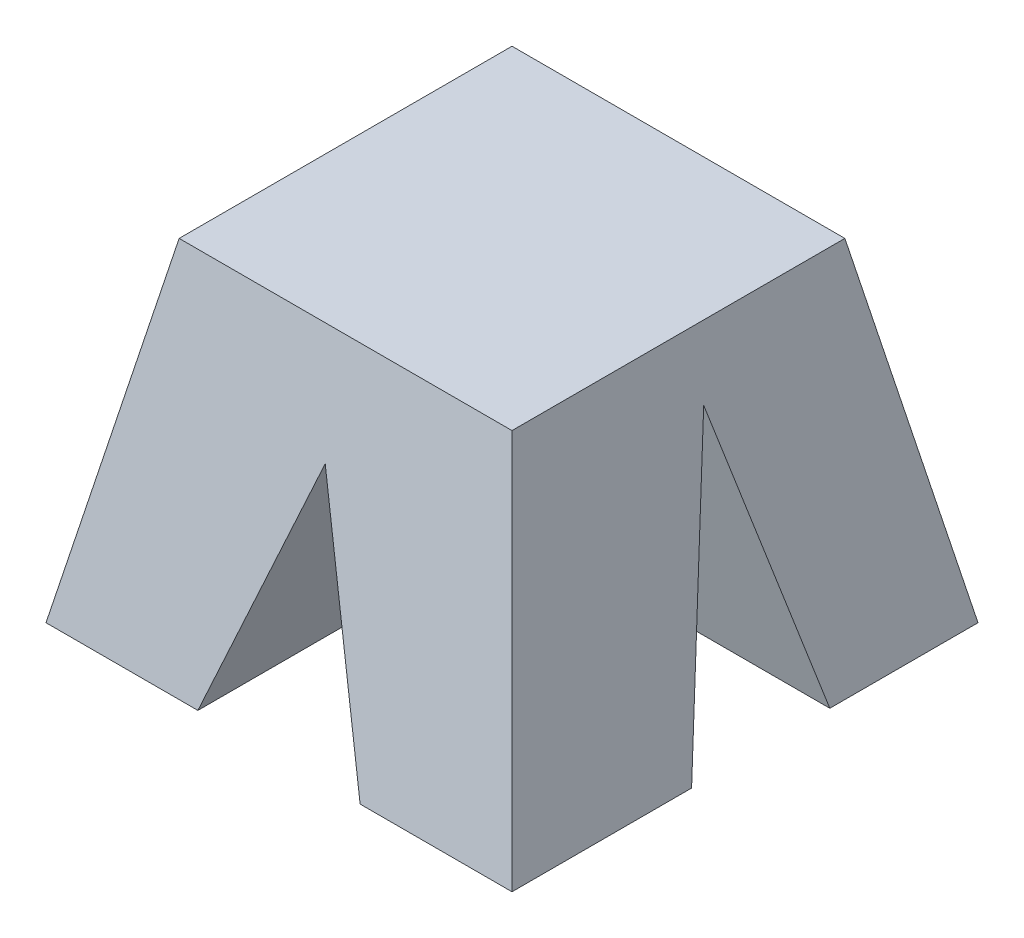
ISO-10303-21;
HEADER;
FILE_DESCRIPTION(('STEP AP214'),'2;1');
FILE_NAME('part.step','',(''),(''),'','','');
FILE_SCHEMA(('AUTOMOTIVE_DESIGN { 1 0 10303 214 1 1 1 1 }'));
ENDSEC;
DATA;
#1=APPLICATION_CONTEXT('core data for automotive mechanical design processes');
#2=APPLICATION_PROTOCOL_DEFINITION('international standard','automotive_design',2000,#1);
#3=PRODUCT_CONTEXT('',#1,'mechanical');
#4=PRODUCT('Part','Part','',(#3));
#5=PRODUCT_RELATED_PRODUCT_CATEGORY('part','',(#4));
#6=PRODUCT_DEFINITION_FORMATION('','',#4);
#7=PRODUCT_DEFINITION_CONTEXT('part definition',#1,'design');
#8=PRODUCT_DEFINITION('design','',#6,#7);
#9=PRODUCT_DEFINITION_SHAPE('','',#8);
#10=(LENGTH_UNIT() NAMED_UNIT(*) SI_UNIT(.MILLI.,.METRE.));
#11=(NAMED_UNIT(*) PLANE_ANGLE_UNIT() SI_UNIT($,.RADIAN.));
#12=(NAMED_UNIT(*) SI_UNIT($,.STERADIAN.) SOLID_ANGLE_UNIT());
#13=UNCERTAINTY_MEASURE_WITH_UNIT(LENGTH_MEASURE(1.E-05),#10,'distance_accuracy_value','');
#14=(GEOMETRIC_REPRESENTATION_CONTEXT(3) GLOBAL_UNCERTAINTY_ASSIGNED_CONTEXT((#13)) GLOBAL_UNIT_ASSIGNED_CONTEXT((#10,
#11,#12)) REPRESENTATION_CONTEXT('',''));
#15=CARTESIAN_POINT('',(0.,0.,0.));
#16=DIRECTION('',(0.,0.,1.));
#17=DIRECTION('',(1.,0.,0.));
#18=AXIS2_PLACEMENT_3D('',#15,#16,#17);
#19=CARTESIAN_POINT('',(0.,-5.,0.));
#20=DIRECTION('',(0.,-1.,0.));
#21=DIRECTION('',(0.,0.,-1.));
#22=AXIS2_PLACEMENT_3D('',#19,#20,#21);
#23=PLANE('',#22);
#24=DIRECTION('',(0.,0.,1.));
#25=VECTOR('',#24,1.);
#26=CARTESIAN_POINT('',(0.487414429426886,-5.,0.));
#27=LINE('',#26,#25);
#28=CARTESIAN_POINT('',(0.487414429426886,-5.,1.32095885605147));
#29=VERTEX_POINT('',#28);
#30=CARTESIAN_POINT('',(0.487414429426886,-5.,2.4));
#31=VERTEX_POINT('',#30);
#32=EDGE_CURVE('E167',#29,#31,#27,.T.);
#33=ORIENTED_EDGE('',*,*,#32,.F.);
#34=DIRECTION('',(-1.,0.,0.));
#35=VECTOR('',#34,1.);
#36=CARTESIAN_POINT('',(0.,-5.,1.32095885605147));
#37=LINE('',#36,#35);
#38=CARTESIAN_POINT('',(1.4,-5.,1.32095885605147));
#39=VERTEX_POINT('',#38);
#40=EDGE_CURVE('E207',#39,#29,#37,.T.);
#41=ORIENTED_EDGE('',*,*,#40,.F.);
#42=DIRECTION('',(0.,0.,1.));
#43=VECTOR('',#42,1.);
#44=CARTESIAN_POINT('',(1.4,-5.,-0.4));
#45=LINE('',#44,#43);
#46=CARTESIAN_POINT('',(1.4,-5.,2.4));
#47=VERTEX_POINT('',#46);
#48=EDGE_CURVE('E290',#39,#47,#45,.T.);
#49=ORIENTED_EDGE('',*,*,#48,.T.);
#50=DIRECTION('',(-1.,0.,0.));
#51=VECTOR('',#50,1.);
#52=CARTESIAN_POINT('',(1.4,-5.,2.4));
#53=LINE('',#52,#51);
#54=EDGE_CURVE('E304',#47,#31,#53,.T.);
#55=ORIENTED_EDGE('',*,*,#54,.T.);
#56=EDGE_LOOP('',(#33,#41,#49,#55));
#57=FACE_BOUND('',#56,.T.);
#58=ADVANCED_FACE('F44',(#57),#23,.T.);
#59=DIRECTION('',(0.,0.,1.));
#60=VECTOR('',#59,1.);
#61=CARTESIAN_POINT('',(0.487414429426886,-5.,0.));
#62=LINE('',#61,#60);
#63=CARTESIAN_POINT('',(0.487414429426886,-5.,-0.4));
#64=VERTEX_POINT('',#63);
#65=CARTESIAN_POINT('',(0.487414429426886,-5.,0.490309637659192));
#66=VERTEX_POINT('',#65);
#67=EDGE_CURVE('E164',#64,#66,#62,.T.);
#68=ORIENTED_EDGE('',*,*,#67,.F.);
#69=DIRECTION('',(1.,0.,0.));
#70=VECTOR('',#69,1.);
#71=CARTESIAN_POINT('',(1.4,-5.,-0.4));
#72=LINE('',#71,#70);
#73=CARTESIAN_POINT('',(1.4,-5.,-0.4));
#74=VERTEX_POINT('',#73);
#75=EDGE_CURVE('E161',#64,#74,#72,.T.);
#76=ORIENTED_EDGE('',*,*,#75,.T.);
#77=CARTESIAN_POINT('',(1.4,-5.,0.490309637659191));
#78=VERTEX_POINT('',#77);
#79=EDGE_CURVE('E287',#74,#78,#45,.T.);
#80=ORIENTED_EDGE('',*,*,#79,.T.);
#81=DIRECTION('',(1.,0.,0.));
#82=VECTOR('',#81,1.);
#83=CARTESIAN_POINT('',(0.,-5.,0.490309637659192));
#84=LINE('',#83,#82);
#85=EDGE_CURVE('E187',#66,#78,#84,.T.);
#86=ORIENTED_EDGE('',*,*,#85,.F.);
#87=EDGE_LOOP('',(#68,#76,#80,#86));
#88=FACE_BOUND('',#87,.T.);
#89=ADVANCED_FACE('F472',(#88),#23,.T.);
#90=DIRECTION('',(0.,0.,-1.));
#91=VECTOR('',#90,1.);
#92=CARTESIAN_POINT('',(-0.487414429426885,-5.,0.));
#93=LINE('',#92,#91);
#94=CARTESIAN_POINT('',(-0.487414429426885,-5.,2.4));
#95=VERTEX_POINT('',#94);
#96=CARTESIAN_POINT('',(-0.487414429426885,-5.,1.32095885605147));
#97=VERTEX_POINT('',#96);
#98=EDGE_CURVE('E63',#95,#97,#93,.T.);
#99=ORIENTED_EDGE('',*,*,#98,.F.);
#100=CARTESIAN_POINT('',(-1.4,-5.,2.4));
#101=VERTEX_POINT('',#100);
#102=EDGE_CURVE('E49',#95,#101,#53,.T.);
#103=ORIENTED_EDGE('',*,*,#102,.T.);
#104=DIRECTION('',(0.,0.,-1.));
#105=VECTOR('',#104,1.);
#106=CARTESIAN_POINT('',(-1.4,-5.,-0.4));
#107=LINE('',#106,#105);
#108=CARTESIAN_POINT('',(-1.4,-5.,1.32095885605147));
#109=VERTEX_POINT('',#108);
#110=EDGE_CURVE('E292',#101,#109,#107,.T.);
#111=ORIENTED_EDGE('',*,*,#110,.T.);
#112=EDGE_CURVE('E204',#97,#109,#37,.T.);
#113=ORIENTED_EDGE('',*,*,#112,.F.);
#114=EDGE_LOOP('',(#99,#103,#111,#113));
#115=FACE_BOUND('',#114,.T.);
#116=ADVANCED_FACE('F470',(#115),#23,.T.);
#117=DIRECTION('',(0.,0.,-1.));
#118=VECTOR('',#117,1.);
#119=CARTESIAN_POINT('',(-0.487414429426885,-5.,0.));
#120=LINE('',#119,#118);
#121=CARTESIAN_POINT('',(-0.487414429426885,-5.,0.490309637659192));
#122=VERTEX_POINT('',#121);
#123=CARTESIAN_POINT('',(-0.487414429426885,-5.,-0.4));
#124=VERTEX_POINT('',#123);
#125=EDGE_CURVE('E144',#122,#124,#120,.T.);
#126=ORIENTED_EDGE('',*,*,#125,.F.);
#127=CARTESIAN_POINT('',(-1.4,-5.,0.490309637659191));
#128=VERTEX_POINT('',#127);
#129=EDGE_CURVE('E188',#128,#122,#84,.T.);
#130=ORIENTED_EDGE('',*,*,#129,.F.);
#131=CARTESIAN_POINT('',(-1.4,-5.,-0.4));
#132=VERTEX_POINT('',#131);
#133=EDGE_CURVE('E199',#128,#132,#107,.T.);
#134=ORIENTED_EDGE('',*,*,#133,.T.);
#135=EDGE_CURVE('E302',#132,#124,#72,.T.);
#136=ORIENTED_EDGE('',*,*,#135,.T.);
#137=EDGE_LOOP('',(#126,#130,#134,#136));
#138=FACE_BOUND('',#137,.T.);
#139=ADVANCED_FACE('F46',(#138),#23,.T.);
#140=CARTESIAN_POINT('',(0.,-3.,0.));
#141=DIRECTION('',(0.,-1.,0.));
#142=DIRECTION('',(0.,0.,-1.));
#143=AXIS2_PLACEMENT_3D('',#140,#141,#142);
#144=PLANE('',#143);
#145=DIRECTION('',(0.,0.,-1.));
#146=VECTOR('',#145,1.);
#147=CARTESIAN_POINT('',(-1.,-3.,2.));
#148=LINE('',#147,#146);
#149=CARTESIAN_POINT('',(-1.,-3.,2.));
#150=VERTEX_POINT('',#149);
#151=CARTESIAN_POINT('',(-1.,-3.,0.));
#152=VERTEX_POINT('',#151);
#153=EDGE_CURVE('E217',#150,#152,#148,.T.);
#154=ORIENTED_EDGE('',*,*,#153,.F.);
#155=DIRECTION('',(-1.,0.,0.));
#156=VECTOR('',#155,1.);
#157=CARTESIAN_POINT('',(-1.,-3.,2.));
#158=LINE('',#157,#156);
#159=CARTESIAN_POINT('',(1.,-3.,2.));
#160=VERTEX_POINT('',#159);
#161=EDGE_CURVE('E225',#160,#150,#158,.T.);
#162=ORIENTED_EDGE('',*,*,#161,.F.);
#163=DIRECTION('',(0.,0.,1.));
#164=VECTOR('',#163,1.);
#165=CARTESIAN_POINT('',(1.,-3.,2.));
#166=LINE('',#165,#164);
#167=CARTESIAN_POINT('',(1.,-3.,0.));
#168=VERTEX_POINT('',#167);
#169=EDGE_CURVE('E390',#168,#160,#166,.T.);
#170=ORIENTED_EDGE('',*,*,#169,.F.);
#171=DIRECTION('',(1.,0.,0.));
#172=VECTOR('',#171,1.);
#173=CARTESIAN_POINT('',(-1.,-3.,0.));
#174=LINE('',#173,#172);
#175=EDGE_CURVE('E400',#152,#168,#174,.T.);
#176=ORIENTED_EDGE('',*,*,#175,.F.);
#177=EDGE_LOOP('',(#154,#162,#170,#176));
#178=FACE_BOUND('',#177,.T.);
#179=ADVANCED_FACE('F367',(#178),#144,.F.);
#180=CARTESIAN_POINT('',(0.,-0.115384615384615,0.576923076923077));
#181=DIRECTION('',(0.,-0.196116135138184,0.98058067569092));
#182=DIRECTION('',(0.,-0.98058067569092,-0.196116135138184));
#183=AXIS2_PLACEMENT_3D('',#180,#181,#182);
#184=PLANE('',#183);
#185=ORIENTED_EDGE('',*,*,#75,.F.);
#186=DIRECTION('',(-0.325479744786791,0.927187089935885,0.185437417987177));
#187=VECTOR('',#186,1.);
#188=CARTESIAN_POINT('',(-1.09726636070957,-0.485754201858567,0.502849159628287));
#189=LINE('',#188,#187);
#190=CARTESIAN_POINT('',(0.,-3.61151308598601,-0.122302617197201));
#191=VERTEX_POINT('',#190);
#192=EDGE_CURVE('E153',#64,#191,#189,.T.);
#193=ORIENTED_EDGE('',*,*,#192,.T.);
#194=DIRECTION('',(-0.32547974478679,-0.927187089935885,-0.185437417987177));
#195=VECTOR('',#194,1.);
#196=CARTESIAN_POINT('',(1.09726636070957,-0.485754201858565,0.502849159628287));
#197=LINE('',#196,#195);
#198=EDGE_CURVE('E141',#191,#124,#197,.T.);
#199=ORIENTED_EDGE('',*,*,#198,.T.);
#200=ORIENTED_EDGE('',*,*,#135,.F.);
#201=DIRECTION('',(-0.192450089729875,-0.962250448649376,-0.192450089729875));
#202=VECTOR('',#201,1.);
#203=CARTESIAN_POINT('',(-1.,-3.,0.));
#204=LINE('',#203,#202);
#205=EDGE_CURVE('E386',#152,#132,#204,.T.);
#206=ORIENTED_EDGE('',*,*,#205,.F.);
#207=ORIENTED_EDGE('',*,*,#175,.T.);
#208=DIRECTION('',(0.192450089729875,-0.962250448649376,-0.192450089729875));
#209=VECTOR('',#208,1.);
#210=CARTESIAN_POINT('',(1.,-3.,0.));
#211=LINE('',#210,#209);
#212=EDGE_CURVE('E379',#168,#74,#211,.T.);
#213=ORIENTED_EDGE('',*,*,#212,.T.);
#214=EDGE_LOOP('',(#185,#193,#199,#200,#206,#207,#213));
#215=FACE_BOUND('',#214,.T.);
#216=ADVANCED_FACE('F159',(#215),#184,.F.);
#217=CARTESIAN_POINT('',(-0.384615384615385,0.0769230769230769,0.));
#218=DIRECTION('',(0.98058067569092,-0.196116135138184,0.));
#219=DIRECTION('',(0.196116135138184,0.98058067569092,0.));
#220=AXIS2_PLACEMENT_3D('',#217,#218,#219);
#221=PLANE('',#220);
#222=DIRECTION('',(0.189806623788741,0.949033118943708,0.251613959695995));
#223=VECTOR('',#222,1.);
#224=CARTESIAN_POINT('',(-0.47231516874654,-0.361575843732697,1.72007943748132));
#225=LINE('',#224,#223);
#226=CARTESIAN_POINT('',(-1.07410829607963,-3.37054148039817,0.922322495897188));
#227=VERTEX_POINT('',#226);
#228=EDGE_CURVE('E191',#128,#227,#225,.T.);
#229=ORIENTED_EDGE('',*,*,#228,.T.);
#230=DIRECTION('',(-0.190705484571187,-0.953527422855936,0.233274242076114));
#231=VECTOR('',#230,1.);
#232=CARTESIAN_POINT('',(-0.38110436882567,0.0944781558716519,0.0746281243931838));
#233=LINE('',#232,#231);
#234=EDGE_CURVE('E213',#227,#109,#233,.T.);
#235=ORIENTED_EDGE('',*,*,#234,.T.);
#236=ORIENTED_EDGE('',*,*,#110,.F.);
#237=DIRECTION('',(-0.192450089729875,-0.962250448649376,0.192450089729875));
#238=VECTOR('',#237,1.);
#239=CARTESIAN_POINT('',(-1.,-3.,2.));
#240=LINE('',#239,#238);
#241=EDGE_CURVE('E291',#150,#101,#240,.T.);
#242=ORIENTED_EDGE('',*,*,#241,.F.);
#243=ORIENTED_EDGE('',*,*,#153,.T.);
#244=ORIENTED_EDGE('',*,*,#205,.T.);
#245=ORIENTED_EDGE('',*,*,#133,.F.);
#246=EDGE_LOOP('',(#229,#235,#236,#242,#243,#244,#245));
#247=FACE_BOUND('',#246,.T.);
#248=ADVANCED_FACE('F366',(#247),#221,.F.);
#249=CARTESIAN_POINT('',(0.384615384615385,0.076923076923077,0.));
#250=DIRECTION('',(-0.98058067569092,-0.196116135138184,0.));
#251=DIRECTION('',(0.196116135138184,-0.98058067569092,0.));
#252=AXIS2_PLACEMENT_3D('',#249,#250,#251);
#253=PLANE('',#252);
#254=ORIENTED_EDGE('',*,*,#48,.F.);
#255=DIRECTION('',(-0.190705484571187,0.953527422855936,-0.233274242076114));
#256=VECTOR('',#255,1.);
#257=CARTESIAN_POINT('',(0.38110436882567,0.094478155871652,0.0746281243931838));
#258=LINE('',#257,#256);
#259=CARTESIAN_POINT('',(1.07410829607963,-3.37054148039817,0.922322495897188));
#260=VERTEX_POINT('',#259);
#261=EDGE_CURVE('E202',#39,#260,#258,.T.);
#262=ORIENTED_EDGE('',*,*,#261,.T.);
#263=DIRECTION('',(0.189806623788741,-0.949033118943708,-0.251613959695995));
#264=VECTOR('',#263,1.);
#265=CARTESIAN_POINT('',(0.47231516874654,-0.361575843732697,1.72007943748132));
#266=LINE('',#265,#264);
#267=EDGE_CURVE('E340',#260,#78,#266,.T.);
#268=ORIENTED_EDGE('',*,*,#267,.T.);
#269=ORIENTED_EDGE('',*,*,#79,.F.);
#270=ORIENTED_EDGE('',*,*,#212,.F.);
#271=ORIENTED_EDGE('',*,*,#169,.T.);
#272=DIRECTION('',(0.192450089729875,-0.962250448649376,0.192450089729875));
#273=VECTOR('',#272,1.);
#274=CARTESIAN_POINT('',(1.,-3.,2.));
#275=LINE('',#274,#273);
#276=EDGE_CURVE('E230',#160,#47,#275,.T.);
#277=ORIENTED_EDGE('',*,*,#276,.T.);
#278=EDGE_LOOP('',(#254,#262,#268,#269,#270,#271,#277));
#279=FACE_BOUND('',#278,.T.);
#280=ADVANCED_FACE('F242',(#279),#253,.F.);
#281=CARTESIAN_POINT('',(0.,0.269230769230769,1.34615384615385));
#282=DIRECTION('',(0.,-0.196116135138184,-0.98058067569092));
#283=DIRECTION('',(0.,0.98058067569092,-0.196116135138184));
#284=AXIS2_PLACEMENT_3D('',#281,#282,#283);
#285=PLANE('',#284);
#286=DIRECTION('',(0.32547974478679,0.927187089935885,-0.185437417987177));
#287=VECTOR('',#286,1.);
#288=CARTESIAN_POINT('',(1.21797860767034,-0.141883841961055,1.42837676839221));
#289=LINE('',#288,#287);
#290=CARTESIAN_POINT('',(0.,-3.61151308598601,2.1223026171972));
#291=VERTEX_POINT('',#290);
#292=EDGE_CURVE('E169',#95,#291,#289,.T.);
#293=ORIENTED_EDGE('',*,*,#292,.T.);
#294=DIRECTION('',(0.325479744786791,-0.927187089935885,0.185437417987177));
#295=VECTOR('',#294,1.);
#296=CARTESIAN_POINT('',(-1.21797860767034,-0.141883841961057,1.42837676839221));
#297=LINE('',#296,#295);
#298=EDGE_CURVE('E177',#291,#31,#297,.T.);
#299=ORIENTED_EDGE('',*,*,#298,.T.);
#300=ORIENTED_EDGE('',*,*,#54,.F.);
#301=ORIENTED_EDGE('',*,*,#276,.F.);
#302=ORIENTED_EDGE('',*,*,#161,.T.);
#303=ORIENTED_EDGE('',*,*,#241,.T.);
#304=ORIENTED_EDGE('',*,*,#102,.F.);
#305=EDGE_LOOP('',(#293,#299,#300,#301,#302,#303,#304));
#306=FACE_BOUND('',#305,.T.);
#307=ADVANCED_FACE('F232',(#306),#285,.F.);
#308=CARTESIAN_POINT('',(-1.4,-3.37054148039817,0.922322495897188));
#309=DIRECTION('',(0.,0.237635495450179,0.971354400464706));
#310=DIRECTION('',(0.,-0.971354400464706,0.237635495450179));
#311=AXIS2_PLACEMENT_3D('',#308,#309,#310);
#312=PLANE('',#311);
#313=ORIENTED_EDGE('',*,*,#40,.T.);
#314=DIRECTION('',(-0.322737646496548,0.91937573400738,-0.224919254961108));
#315=VECTOR('',#314,1.);
#316=CARTESIAN_POINT('',(-0.22160316402761,-2.98023695877281,0.826837049670235));
#317=LINE('',#316,#315);
#318=CARTESIAN_POINT('',(0.,-3.61151308598601,0.981274621769984));
#319=VERTEX_POINT('',#318);
#320=EDGE_CURVE('E163',#29,#319,#317,.T.);
#321=ORIENTED_EDGE('',*,*,#320,.T.);
#322=DIRECTION('',(-0.322737646496547,-0.91937573400738,0.224919254961108));
#323=VECTOR('',#322,1.);
#324=CARTESIAN_POINT('',(-0.0700436836775563,-3.81104500856363,1.03008880046437));
#325=LINE('',#324,#323);
#326=EDGE_CURVE('E149',#319,#97,#325,.T.);
#327=ORIENTED_EDGE('',*,*,#326,.T.);
#328=ORIENTED_EDGE('',*,*,#112,.T.);
#329=ORIENTED_EDGE('',*,*,#234,.F.);
#330=DIRECTION('',(1.,0.,0.));
#331=VECTOR('',#330,1.);
#332=CARTESIAN_POINT('',(-1.4,-3.37054148039817,0.922322495897188));
#333=LINE('',#332,#331);
#334=EDGE_CURVE('E182',#227,#260,#333,.T.);
#335=ORIENTED_EDGE('',*,*,#334,.T.);
#336=ORIENTED_EDGE('',*,*,#261,.F.);
#337=EDGE_LOOP('',(#313,#321,#327,#328,#329,#335,#336));
#338=FACE_BOUND('',#337,.T.);
#339=ADVANCED_FACE('F241',(#338),#312,.F.);
#340=CARTESIAN_POINT('',(-1.4,-5.35890374703274,0.395154694024402));
#341=DIRECTION('',(0.,0.256272612996124,-0.966604545731158));
#342=DIRECTION('',(0.,0.966604545731158,0.256272612996124));
#343=AXIS2_PLACEMENT_3D('',#340,#341,#342);
#344=PLANE('',#343);
#345=DIRECTION('',(0.321322783764168,0.91534524522734,0.242682407013252));
#346=VECTOR('',#345,1.);
#347=CARTESIAN_POINT('',(-0.694618721253222,-5.59025837225765,0.333816420169834));
#348=LINE('',#347,#346);
#349=CARTESIAN_POINT('',(0.,-3.61151308598601,0.858434504376153));
#350=VERTEX_POINT('',#349);
#351=EDGE_CURVE('E55',#122,#350,#348,.T.);
#352=ORIENTED_EDGE('',*,*,#351,.T.);
#353=DIRECTION('',(0.321322783764169,-0.91534524522734,-0.242682407013252));
#354=VECTOR('',#353,1.);
#355=CARTESIAN_POINT('',(0.40552339342855,-4.76671878181277,0.552158702627679));
#356=LINE('',#355,#354);
#357=EDGE_CURVE('E12',#350,#66,#356,.T.);
#358=ORIENTED_EDGE('',*,*,#357,.T.);
#359=ORIENTED_EDGE('',*,*,#85,.T.);
#360=ORIENTED_EDGE('',*,*,#267,.F.);
#361=ORIENTED_EDGE('',*,*,#334,.F.);
#362=ORIENTED_EDGE('',*,*,#228,.F.);
#363=ORIENTED_EDGE('',*,*,#129,.T.);
#364=EDGE_LOOP('',(#352,#358,#359,#360,#361,#362,#363));
#365=FACE_BOUND('',#364,.T.);
#366=ADVANCED_FACE('F481',(#365),#344,.F.);
#367=CARTESIAN_POINT('',(0.,-3.61151308598601,-0.4));
#368=DIRECTION('',(-0.943551983681825,0.33122447688855,0.));
#369=DIRECTION('',(-0.33122447688855,-0.943551983681825,0.));
#370=AXIS2_PLACEMENT_3D('',#367,#368,#369);
#371=PLANE('',#370);
#372=DIRECTION('',(0.,0.,1.));
#373=VECTOR('',#372,1.);
#374=CARTESIAN_POINT('',(0.,-3.61151308598601,-0.4));
#375=LINE('',#374,#373);
#376=EDGE_CURVE('E71',#191,#350,#375,.T.);
#377=ORIENTED_EDGE('',*,*,#376,.T.);
#378=ORIENTED_EDGE('',*,*,#351,.F.);
#379=ORIENTED_EDGE('',*,*,#125,.T.);
#380=ORIENTED_EDGE('',*,*,#198,.F.);
#381=EDGE_LOOP('',(#377,#378,#379,#380));
#382=FACE_BOUND('',#381,.T.);
#383=ADVANCED_FACE('F142',(#382),#371,.F.);
#384=CARTESIAN_POINT('',(0.500000000000001,-5.03585224193448,-0.4));
#385=DIRECTION('',(0.943551983681825,0.331224476888551,0.));
#386=DIRECTION('',(-0.331224476888551,0.943551983681825,0.));
#387=AXIS2_PLACEMENT_3D('',#384,#385,#386);
#388=PLANE('',#387);
#389=ORIENTED_EDGE('',*,*,#67,.T.);
#390=ORIENTED_EDGE('',*,*,#357,.F.);
#391=ORIENTED_EDGE('',*,*,#376,.F.);
#392=ORIENTED_EDGE('',*,*,#192,.F.);
#393=EDGE_LOOP('',(#389,#390,#391,#392));
#394=FACE_BOUND('',#393,.T.);
#395=ADVANCED_FACE('F152',(#394),#388,.F.);
#396=EDGE_CURVE('E156',#319,#291,#375,.T.);
#397=ORIENTED_EDGE('',*,*,#396,.F.);
#398=ORIENTED_EDGE('',*,*,#320,.F.);
#399=ORIENTED_EDGE('',*,*,#32,.T.);
#400=ORIENTED_EDGE('',*,*,#298,.F.);
#401=EDGE_LOOP('',(#397,#398,#399,#400));
#402=FACE_BOUND('',#401,.T.);
#403=ADVANCED_FACE('F499',(#402),#388,.F.);
#404=ORIENTED_EDGE('',*,*,#98,.T.);
#405=ORIENTED_EDGE('',*,*,#326,.F.);
#406=ORIENTED_EDGE('',*,*,#396,.T.);
#407=ORIENTED_EDGE('',*,*,#292,.F.);
#408=EDGE_LOOP('',(#404,#405,#406,#407));
#409=FACE_BOUND('',#408,.T.);
#410=ADVANCED_FACE('F498',(#409),#371,.F.);
#411=CLOSED_SHELL('',(#58,#89,#116,#139,#179,#216,#248,#280,#307,#339,#366,#383,#395,#403,#410));
#412=MANIFOLD_SOLID_BREP('B2',#411);
#413=ADVANCED_BREP_SHAPE_REPRESENTATION('',(#18,#412),#14);
#414=SHAPE_DEFINITION_REPRESENTATION(#9,#413);
ENDSEC;
END-ISO-10303-21;
